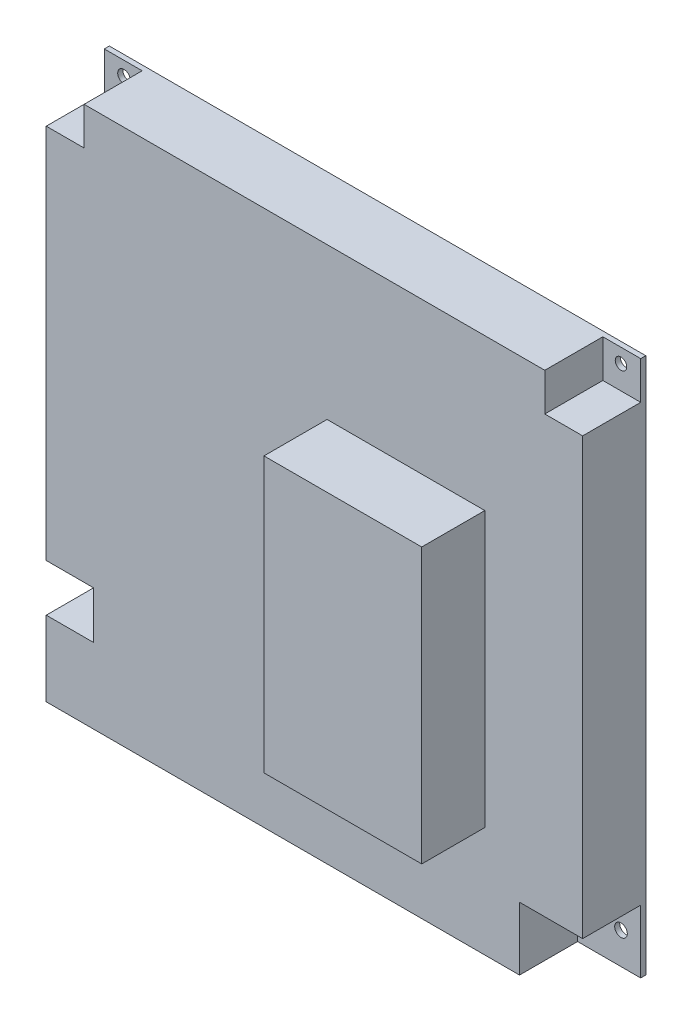
ISO-10303-21;
HEADER;
FILE_DESCRIPTION(('STEP AP214'),'2;1');
FILE_NAME('part.step','',(''),(''),'','','');
FILE_SCHEMA(('AUTOMOTIVE_DESIGN { 1 0 10303 214 1 1 1 1 }'));
ENDSEC;
DATA;
#1=APPLICATION_CONTEXT('core data for automotive mechanical design processes');
#2=APPLICATION_PROTOCOL_DEFINITION('international standard','automotive_design',2000,#1);
#3=PRODUCT_CONTEXT('',#1,'mechanical');
#4=PRODUCT('Part','Part','',(#3));
#5=PRODUCT_RELATED_PRODUCT_CATEGORY('part','',(#4));
#6=PRODUCT_DEFINITION_FORMATION('','',#4);
#7=PRODUCT_DEFINITION_CONTEXT('part definition',#1,'design');
#8=PRODUCT_DEFINITION('design','',#6,#7);
#9=PRODUCT_DEFINITION_SHAPE('','',#8);
#10=(LENGTH_UNIT() NAMED_UNIT(*) SI_UNIT(.MILLI.,.METRE.));
#11=(NAMED_UNIT(*) PLANE_ANGLE_UNIT() SI_UNIT($,.RADIAN.));
#12=(NAMED_UNIT(*) SI_UNIT($,.STERADIAN.) SOLID_ANGLE_UNIT());
#13=UNCERTAINTY_MEASURE_WITH_UNIT(LENGTH_MEASURE(1.E-05),#10,'distance_accuracy_value','');
#14=(GEOMETRIC_REPRESENTATION_CONTEXT(3) GLOBAL_UNCERTAINTY_ASSIGNED_CONTEXT((#13)) GLOBAL_UNIT_ASSIGNED_CONTEXT((#10,
#11,#12)) REPRESENTATION_CONTEXT('',''));
#15=CARTESIAN_POINT('',(0.,0.,0.));
#16=DIRECTION('',(0.,0.,1.));
#17=DIRECTION('',(1.,0.,0.));
#18=AXIS2_PLACEMENT_3D('',#15,#16,#17);
#19=CARTESIAN_POINT('',(0.,0.,20.));
#20=DIRECTION('',(0.,0.,1.));
#21=DIRECTION('',(1.,0.,0.));
#22=AXIS2_PLACEMENT_3D('',#19,#20,#21);
#23=PLANE('',#22);
#24=DIRECTION('',(0.,-1.,0.));
#25=VECTOR('',#24,1.);
#26=CARTESIAN_POINT('',(65.,-65.,20.));
#27=LINE('',#26,#25);
#28=CARTESIAN_POINT('',(65.,-65.,20.));
#29=VERTEX_POINT('',#28);
#30=CARTESIAN_POINT('',(65.,-85.,20.));
#31=VERTEX_POINT('',#30);
#32=EDGE_CURVE('E242',#29,#31,#27,.T.);
#33=ORIENTED_EDGE('',*,*,#32,.F.);
#34=DIRECTION('',(-1.,0.,0.));
#35=VECTOR('',#34,1.);
#36=CARTESIAN_POINT('',(65.,-65.,20.));
#37=LINE('',#36,#35);
#38=CARTESIAN_POINT('',(85.,-65.,20.));
#39=VERTEX_POINT('',#38);
#40=EDGE_CURVE('E234',#39,#29,#37,.T.);
#41=ORIENTED_EDGE('',*,*,#40,.F.);
#42=DIRECTION('',(0.,1.,0.));
#43=VECTOR('',#42,1.);
#44=CARTESIAN_POINT('',(85.,85.,20.));
#45=LINE('',#44,#43);
#46=CARTESIAN_POINT('',(85.,73.,20.));
#47=VERTEX_POINT('',#46);
#48=EDGE_CURVE('E332',#39,#47,#45,.T.);
#49=ORIENTED_EDGE('',*,*,#48,.T.);
#50=DIRECTION('',(1.,0.,0.));
#51=VECTOR('',#50,1.);
#52=CARTESIAN_POINT('',(73.,73.,20.));
#53=LINE('',#52,#51);
#54=CARTESIAN_POINT('',(73.,73.,20.));
#55=VERTEX_POINT('',#54);
#56=EDGE_CURVE('E258',#55,#47,#53,.T.);
#57=ORIENTED_EDGE('',*,*,#56,.F.);
#58=DIRECTION('',(0.,-1.,0.));
#59=VECTOR('',#58,1.);
#60=CARTESIAN_POINT('',(73.,85.,20.));
#61=LINE('',#60,#59);
#62=CARTESIAN_POINT('',(73.,85.,20.));
#63=VERTEX_POINT('',#62);
#64=EDGE_CURVE('E56',#63,#55,#61,.T.);
#65=ORIENTED_EDGE('',*,*,#64,.F.);
#66=DIRECTION('',(-1.,0.,0.));
#67=VECTOR('',#66,1.);
#68=CARTESIAN_POINT('',(-85.,85.,20.));
#69=LINE('',#68,#67);
#70=CARTESIAN_POINT('',(-73.,85.,20.));
#71=VERTEX_POINT('',#70);
#72=EDGE_CURVE('E335',#63,#71,#69,.T.);
#73=ORIENTED_EDGE('',*,*,#72,.T.);
#74=DIRECTION('',(0.,1.,0.));
#75=VECTOR('',#74,1.);
#76=CARTESIAN_POINT('',(-73.,85.,20.));
#77=LINE('',#76,#75);
#78=CARTESIAN_POINT('',(-73.,73.,20.));
#79=VERTEX_POINT('',#78);
#80=EDGE_CURVE('E279',#79,#71,#77,.T.);
#81=ORIENTED_EDGE('',*,*,#80,.F.);
#82=DIRECTION('',(1.,0.,0.));
#83=VECTOR('',#82,1.);
#84=CARTESIAN_POINT('',(-85.,73.,20.));
#85=LINE('',#84,#83);
#86=CARTESIAN_POINT('',(-85.,73.,20.));
#87=VERTEX_POINT('',#86);
#88=EDGE_CURVE('E288',#87,#79,#85,.T.);
#89=ORIENTED_EDGE('',*,*,#88,.F.);
#90=DIRECTION('',(0.,-1.,0.));
#91=VECTOR('',#90,1.);
#92=CARTESIAN_POINT('',(-85.,85.,20.));
#93=LINE('',#92,#91);
#94=CARTESIAN_POINT('',(-85.,-46.2117176918819,20.));
#95=VERTEX_POINT('',#94);
#96=EDGE_CURVE('E327',#87,#95,#93,.T.);
#97=ORIENTED_EDGE('',*,*,#96,.T.);
#98=DIRECTION('',(-1.,0.,0.));
#99=VECTOR('',#98,1.);
#100=CARTESIAN_POINT('',(-85.,-46.2117176918819,20.));
#101=LINE('',#100,#99);
#102=CARTESIAN_POINT('',(-70.,-46.2117176918819,20.));
#103=VERTEX_POINT('',#102);
#104=EDGE_CURVE('E302',#103,#95,#101,.T.);
#105=ORIENTED_EDGE('',*,*,#104,.F.);
#106=DIRECTION('',(0.,1.,0.));
#107=VECTOR('',#106,1.);
#108=CARTESIAN_POINT('',(-70.,-46.2117176918819,20.));
#109=LINE('',#108,#107);
#110=CARTESIAN_POINT('',(-70.,-61.2117176918819,20.));
#111=VERTEX_POINT('',#110);
#112=EDGE_CURVE('E314',#111,#103,#109,.T.);
#113=ORIENTED_EDGE('',*,*,#112,.F.);
#114=DIRECTION('',(1.,0.,0.));
#115=VECTOR('',#114,1.);
#116=CARTESIAN_POINT('',(-85.,-61.2117176918819,20.));
#117=LINE('',#116,#115);
#118=CARTESIAN_POINT('',(-85.,-61.2117176918819,20.));
#119=VERTEX_POINT('',#118);
#120=EDGE_CURVE('E229',#119,#111,#117,.T.);
#121=ORIENTED_EDGE('',*,*,#120,.F.);
#122=CARTESIAN_POINT('',(-85.,-85.,20.));
#123=VERTEX_POINT('',#122);
#124=EDGE_CURVE('E325',#119,#123,#93,.T.);
#125=ORIENTED_EDGE('',*,*,#124,.T.);
#126=DIRECTION('',(1.,0.,0.));
#127=VECTOR('',#126,1.);
#128=CARTESIAN_POINT('',(-85.,-85.,20.));
#129=LINE('',#128,#127);
#130=EDGE_CURVE('E329',#123,#31,#129,.T.);
#131=ORIENTED_EDGE('',*,*,#130,.T.);
#132=EDGE_LOOP('',(#33,#41,#49,#57,#65,#73,#81,#89,#97,#105,#113,#121,#125,#131));
#133=FACE_BOUND('',#132,.T.);
#134=DIRECTION('',(1.,0.,0.));
#135=VECTOR('',#134,1.);
#136=CARTESIAN_POINT('',(4.,-50.,20.));
#137=LINE('',#136,#135);
#138=CARTESIAN_POINT('',(4.,-50.,20.));
#139=VERTEX_POINT('',#138);
#140=CARTESIAN_POINT('',(54.,-50.,20.));
#141=VERTEX_POINT('',#140);
#142=EDGE_CURVE('E655',#139,#141,#137,.T.);
#143=ORIENTED_EDGE('',*,*,#142,.F.);
#144=DIRECTION('',(0.,-1.,0.));
#145=VECTOR('',#144,1.);
#146=CARTESIAN_POINT('',(3.99999999999998,37.,20.));
#147=LINE('',#146,#145);
#148=CARTESIAN_POINT('',(3.99999999999998,37.,20.));
#149=VERTEX_POINT('',#148);
#150=EDGE_CURVE('E199',#149,#139,#147,.T.);
#151=ORIENTED_EDGE('',*,*,#150,.F.);
#152=DIRECTION('',(-1.,0.,0.));
#153=VECTOR('',#152,1.);
#154=CARTESIAN_POINT('',(3.99999999999998,37.,20.));
#155=LINE('',#154,#153);
#156=CARTESIAN_POINT('',(54.,37.,20.));
#157=VERTEX_POINT('',#156);
#158=EDGE_CURVE('E195',#157,#149,#155,.T.);
#159=ORIENTED_EDGE('',*,*,#158,.F.);
#160=DIRECTION('',(0.,1.,0.));
#161=VECTOR('',#160,1.);
#162=CARTESIAN_POINT('',(54.,37.,20.));
#163=LINE('',#162,#161);
#164=EDGE_CURVE('E652',#141,#157,#163,.T.);
#165=ORIENTED_EDGE('',*,*,#164,.F.);
#166=EDGE_LOOP('',(#143,#151,#159,#165));
#167=FACE_BOUND('',#166,.T.);
#168=ADVANCED_FACE('F33',(#133,#167),#23,.T.);
#169=CARTESIAN_POINT('',(-85.,85.,20.));
#170=DIRECTION('',(1.,0.,0.));
#171=DIRECTION('',(0.,1.,0.));
#172=AXIS2_PLACEMENT_3D('',#169,#170,#171);
#173=PLANE('',#172);
#174=ORIENTED_EDGE('',*,*,#96,.F.);
#175=DIRECTION('',(0.,0.,1.));
#176=VECTOR('',#175,1.);
#177=CARTESIAN_POINT('',(-85.,73.,1.6));
#178=LINE('',#177,#176);
#179=CARTESIAN_POINT('',(-85.,73.,1.6));
#180=VERTEX_POINT('',#179);
#181=EDGE_CURVE('E287',#180,#87,#178,.T.);
#182=ORIENTED_EDGE('',*,*,#181,.F.);
#183=DIRECTION('',(0.,-1.,0.));
#184=VECTOR('',#183,1.);
#185=CARTESIAN_POINT('',(-85.,85.,1.6));
#186=LINE('',#185,#184);
#187=CARTESIAN_POINT('',(-85.,85.,1.6));
#188=VERTEX_POINT('',#187);
#189=EDGE_CURVE('E275',#188,#180,#186,.T.);
#190=ORIENTED_EDGE('',*,*,#189,.F.);
#191=DIRECTION('',(0.,0.,-1.));
#192=VECTOR('',#191,1.);
#193=CARTESIAN_POINT('',(-85.,85.,20.));
#194=LINE('',#193,#192);
#195=CARTESIAN_POINT('',(-85.,85.,0.));
#196=VERTEX_POINT('',#195);
#197=EDGE_CURVE('E338',#188,#196,#194,.T.);
#198=ORIENTED_EDGE('',*,*,#197,.T.);
#199=DIRECTION('',(0.,-1.,0.));
#200=VECTOR('',#199,1.);
#201=CARTESIAN_POINT('',(-85.,85.,0.));
#202=LINE('',#201,#200);
#203=CARTESIAN_POINT('',(-85.,-85.,0.));
#204=VERTEX_POINT('',#203);
#205=EDGE_CURVE('E249',#196,#204,#202,.T.);
#206=ORIENTED_EDGE('',*,*,#205,.T.);
#207=DIRECTION('',(0.,0.,-1.));
#208=VECTOR('',#207,1.);
#209=CARTESIAN_POINT('',(-85.,-85.,20.));
#210=LINE('',#209,#208);
#211=EDGE_CURVE('E11',#123,#204,#210,.T.);
#212=ORIENTED_EDGE('',*,*,#211,.F.);
#213=ORIENTED_EDGE('',*,*,#124,.F.);
#214=DIRECTION('',(0.,0.,1.));
#215=VECTOR('',#214,1.);
#216=CARTESIAN_POINT('',(-85.,-61.2117176918819,1.6));
#217=LINE('',#216,#215);
#218=CARTESIAN_POINT('',(-85.,-61.2117176918819,1.6));
#219=VERTEX_POINT('',#218);
#220=EDGE_CURVE('E311',#219,#119,#217,.T.);
#221=ORIENTED_EDGE('',*,*,#220,.F.);
#222=DIRECTION('',(0.,-1.,0.));
#223=VECTOR('',#222,1.);
#224=CARTESIAN_POINT('',(-85.,-46.2117176918819,1.6));
#225=LINE('',#224,#223);
#226=CARTESIAN_POINT('',(-85.,-46.2117176918819,1.6));
#227=VERTEX_POINT('',#226);
#228=EDGE_CURVE('E298',#227,#219,#225,.T.);
#229=ORIENTED_EDGE('',*,*,#228,.F.);
#230=DIRECTION('',(0.,0.,1.));
#231=VECTOR('',#230,1.);
#232=CARTESIAN_POINT('',(-85.,-46.2117176918819,1.6));
#233=LINE('',#232,#231);
#234=EDGE_CURVE('E291',#227,#95,#233,.T.);
#235=ORIENTED_EDGE('',*,*,#234,.T.);
#236=EDGE_LOOP('',(#174,#182,#190,#198,#206,#212,#213,#221,#229,#235));
#237=FACE_BOUND('',#236,.T.);
#238=ADVANCED_FACE('F35',(#237),#173,.F.);
#239=CARTESIAN_POINT('',(-85.,-85.,20.));
#240=DIRECTION('',(0.,1.,0.));
#241=DIRECTION('',(0.,0.,1.));
#242=AXIS2_PLACEMENT_3D('',#239,#240,#241);
#243=PLANE('',#242);
#244=DIRECTION('',(1.,0.,0.));
#245=VECTOR('',#244,1.);
#246=CARTESIAN_POINT('',(65.,-85.,1.6));
#247=LINE('',#246,#245);
#248=CARTESIAN_POINT('',(65.,-85.,1.6));
#249=VERTEX_POINT('',#248);
#250=CARTESIAN_POINT('',(85.,-85.,1.6));
#251=VERTEX_POINT('',#250);
#252=EDGE_CURVE('E233',#249,#251,#247,.T.);
#253=ORIENTED_EDGE('',*,*,#252,.F.);
#254=DIRECTION('',(0.,0.,1.));
#255=VECTOR('',#254,1.);
#256=CARTESIAN_POINT('',(65.,-85.,1.6));
#257=LINE('',#256,#255);
#258=EDGE_CURVE('E241',#249,#31,#257,.T.);
#259=ORIENTED_EDGE('',*,*,#258,.T.);
#260=ORIENTED_EDGE('',*,*,#130,.F.);
#261=ORIENTED_EDGE('',*,*,#211,.T.);
#262=DIRECTION('',(1.,0.,0.));
#263=VECTOR('',#262,1.);
#264=CARTESIAN_POINT('',(-85.,-85.,0.));
#265=LINE('',#264,#263);
#266=CARTESIAN_POINT('',(85.,-85.,0.));
#267=VERTEX_POINT('',#266);
#268=EDGE_CURVE('E341',#204,#267,#265,.T.);
#269=ORIENTED_EDGE('',*,*,#268,.T.);
#270=DIRECTION('',(0.,0.,-1.));
#271=VECTOR('',#270,1.);
#272=CARTESIAN_POINT('',(85.,-85.,20.));
#273=LINE('',#272,#271);
#274=EDGE_CURVE('E41',#251,#267,#273,.T.);
#275=ORIENTED_EDGE('',*,*,#274,.F.);
#276=EDGE_LOOP('',(#253,#259,#260,#261,#269,#275));
#277=FACE_BOUND('',#276,.T.);
#278=ADVANCED_FACE('F362',(#277),#243,.F.);
#279=CARTESIAN_POINT('',(85.,85.,20.));
#280=DIRECTION('',(-1.,0.,0.));
#281=DIRECTION('',(0.,-1.,0.));
#282=AXIS2_PLACEMENT_3D('',#279,#280,#281);
#283=PLANE('',#282);
#284=ORIENTED_EDGE('',*,*,#48,.F.);
#285=DIRECTION('',(0.,0.,1.));
#286=VECTOR('',#285,1.);
#287=CARTESIAN_POINT('',(85.,-65.,1.6));
#288=LINE('',#287,#286);
#289=CARTESIAN_POINT('',(85.,-65.,1.6));
#290=VERTEX_POINT('',#289);
#291=EDGE_CURVE('E250',#290,#39,#288,.T.);
#292=ORIENTED_EDGE('',*,*,#291,.F.);
#293=DIRECTION('',(0.,1.,0.));
#294=VECTOR('',#293,1.);
#295=CARTESIAN_POINT('',(85.,-65.,1.6));
#296=LINE('',#295,#294);
#297=EDGE_CURVE('E236',#251,#290,#296,.T.);
#298=ORIENTED_EDGE('',*,*,#297,.F.);
#299=ORIENTED_EDGE('',*,*,#274,.T.);
#300=DIRECTION('',(0.,1.,0.));
#301=VECTOR('',#300,1.);
#302=CARTESIAN_POINT('',(85.,85.,0.));
#303=LINE('',#302,#301);
#304=CARTESIAN_POINT('',(85.,85.,0.));
#305=VERTEX_POINT('',#304);
#306=EDGE_CURVE('E344',#267,#305,#303,.T.);
#307=ORIENTED_EDGE('',*,*,#306,.T.);
#308=DIRECTION('',(0.,0.,-1.));
#309=VECTOR('',#308,1.);
#310=CARTESIAN_POINT('',(85.,85.,20.));
#311=LINE('',#310,#309);
#312=CARTESIAN_POINT('',(85.,85.,1.6));
#313=VERTEX_POINT('',#312);
#314=EDGE_CURVE('E350',#313,#305,#311,.T.);
#315=ORIENTED_EDGE('',*,*,#314,.F.);
#316=DIRECTION('',(0.,1.,0.));
#317=VECTOR('',#316,1.);
#318=CARTESIAN_POINT('',(85.,85.,1.6));
#319=LINE('',#318,#317);
#320=CARTESIAN_POINT('',(85.,73.,1.6));
#321=VERTEX_POINT('',#320);
#322=EDGE_CURVE('E261',#321,#313,#319,.T.);
#323=ORIENTED_EDGE('',*,*,#322,.F.);
#324=DIRECTION('',(0.,0.,1.));
#325=VECTOR('',#324,1.);
#326=CARTESIAN_POINT('',(85.,73.,1.6));
#327=LINE('',#326,#325);
#328=EDGE_CURVE('E271',#321,#47,#327,.T.);
#329=ORIENTED_EDGE('',*,*,#328,.T.);
#330=EDGE_LOOP('',(#284,#292,#298,#299,#307,#315,#323,#329));
#331=FACE_BOUND('',#330,.T.);
#332=ADVANCED_FACE('F355',(#331),#283,.F.);
#333=CARTESIAN_POINT('',(-85.,85.,20.));
#334=DIRECTION('',(0.,-1.,0.));
#335=DIRECTION('',(0.,0.,-1.));
#336=AXIS2_PLACEMENT_3D('',#333,#334,#335);
#337=PLANE('',#336);
#338=ORIENTED_EDGE('',*,*,#72,.F.);
#339=DIRECTION('',(0.,0.,1.));
#340=VECTOR('',#339,1.);
#341=CARTESIAN_POINT('',(73.,85.,1.6));
#342=LINE('',#341,#340);
#343=CARTESIAN_POINT('',(73.,85.,1.6));
#344=VERTEX_POINT('',#343);
#345=EDGE_CURVE('E244',#344,#63,#342,.T.);
#346=ORIENTED_EDGE('',*,*,#345,.F.);
#347=DIRECTION('',(-1.,0.,0.));
#348=VECTOR('',#347,1.);
#349=CARTESIAN_POINT('',(73.,85.,1.6));
#350=LINE('',#349,#348);
#351=EDGE_CURVE('E263',#313,#344,#350,.T.);
#352=ORIENTED_EDGE('',*,*,#351,.F.);
#353=ORIENTED_EDGE('',*,*,#314,.T.);
#354=DIRECTION('',(-1.,0.,0.));
#355=VECTOR('',#354,1.);
#356=CARTESIAN_POINT('',(-85.,85.,0.));
#357=LINE('',#356,#355);
#358=EDGE_CURVE('E328',#305,#196,#357,.T.);
#359=ORIENTED_EDGE('',*,*,#358,.T.);
#360=ORIENTED_EDGE('',*,*,#197,.F.);
#361=DIRECTION('',(-1.,0.,0.));
#362=VECTOR('',#361,1.);
#363=CARTESIAN_POINT('',(-85.,85.,1.6));
#364=LINE('',#363,#362);
#365=CARTESIAN_POINT('',(-73.,85.,1.6));
#366=VERTEX_POINT('',#365);
#367=EDGE_CURVE('E285',#366,#188,#364,.T.);
#368=ORIENTED_EDGE('',*,*,#367,.F.);
#369=DIRECTION('',(0.,0.,1.));
#370=VECTOR('',#369,1.);
#371=CARTESIAN_POINT('',(-73.,85.,1.6));
#372=LINE('',#371,#370);
#373=EDGE_CURVE('E268',#366,#71,#372,.T.);
#374=ORIENTED_EDGE('',*,*,#373,.T.);
#375=EDGE_LOOP('',(#338,#346,#352,#353,#359,#360,#368,#374));
#376=FACE_BOUND('',#375,.T.);
#377=ADVANCED_FACE('F371',(#376),#337,.F.);
#378=CARTESIAN_POINT('',(0.,0.,0.));
#379=DIRECTION('',(0.,0.,1.));
#380=DIRECTION('',(1.,0.,0.));
#381=AXIS2_PLACEMENT_3D('',#378,#379,#380);
#382=PLANE('',#381);
#383=CARTESIAN_POINT('',(78.75,-75.,0.));
#384=DIRECTION('',(0.,0.,1.));
#385=DIRECTION('',(1.,0.,0.));
#386=AXIS2_PLACEMENT_3D('',#383,#384,#385);
#387=CIRCLE('',#386,2.);
#388=CARTESIAN_POINT('',(80.75,-75.,0.));
#389=VERTEX_POINT('',#388);
#390=EDGE_CURVE('E212',#389,#389,#387,.T.);
#391=ORIENTED_EDGE('',*,*,#390,.T.);
#392=EDGE_LOOP('',(#391));
#393=FACE_BOUND('',#392,.T.);
#394=CARTESIAN_POINT('',(78.75,80.5,0.));
#395=DIRECTION('',(0.,0.,1.));
#396=DIRECTION('',(1.,0.,0.));
#397=AXIS2_PLACEMENT_3D('',#394,#395,#396);
#398=CIRCLE('',#397,1.82271494033159);
#399=CARTESIAN_POINT('',(80.5727149403316,80.5,0.));
#400=VERTEX_POINT('',#399);
#401=EDGE_CURVE('E220',#400,#400,#398,.T.);
#402=ORIENTED_EDGE('',*,*,#401,.T.);
#403=EDGE_LOOP('',(#402));
#404=FACE_BOUND('',#403,.T.);
#405=CARTESIAN_POINT('',(-78.75,80.5,0.));
#406=DIRECTION('',(0.,0.,1.));
#407=DIRECTION('',(1.,0.,0.));
#408=AXIS2_PLACEMENT_3D('',#405,#406,#407);
#409=CIRCLE('',#408,2.);
#410=CARTESIAN_POINT('',(-76.75,80.5,0.));
#411=VERTEX_POINT('',#410);
#412=EDGE_CURVE('E223',#411,#411,#409,.T.);
#413=ORIENTED_EDGE('',*,*,#412,.T.);
#414=EDGE_LOOP('',(#413));
#415=FACE_BOUND('',#414,.T.);
#416=CARTESIAN_POINT('',(-78.75,-51.5,0.));
#417=DIRECTION('',(0.,0.,1.));
#418=DIRECTION('',(1.,0.,0.));
#419=AXIS2_PLACEMENT_3D('',#416,#417,#418);
#420=CIRCLE('',#419,2.);
#421=CARTESIAN_POINT('',(-76.75,-51.5,0.));
#422=VERTEX_POINT('',#421);
#423=EDGE_CURVE('E226',#422,#422,#420,.T.);
#424=ORIENTED_EDGE('',*,*,#423,.T.);
#425=EDGE_LOOP('',(#424));
#426=FACE_BOUND('',#425,.T.);
#427=ORIENTED_EDGE('',*,*,#205,.F.);
#428=ORIENTED_EDGE('',*,*,#358,.F.);
#429=ORIENTED_EDGE('',*,*,#306,.F.);
#430=ORIENTED_EDGE('',*,*,#268,.F.);
#431=EDGE_LOOP('',(#427,#428,#429,#430));
#432=FACE_BOUND('',#431,.T.);
#433=ADVANCED_FACE('F367',(#393,#404,#415,#426,#432),#382,.F.);
#434=CARTESIAN_POINT('',(-85.,-46.2117176918819,1.6));
#435=DIRECTION('',(0.,1.,0.));
#436=DIRECTION('',(0.,0.,1.));
#437=AXIS2_PLACEMENT_3D('',#434,#435,#436);
#438=PLANE('',#437);
#439=ORIENTED_EDGE('',*,*,#104,.T.);
#440=ORIENTED_EDGE('',*,*,#234,.F.);
#441=DIRECTION('',(-1.,0.,0.));
#442=VECTOR('',#441,1.);
#443=CARTESIAN_POINT('',(-85.,-46.2117176918819,1.6));
#444=LINE('',#443,#442);
#445=CARTESIAN_POINT('',(-70.,-46.2117176918819,1.6));
#446=VERTEX_POINT('',#445);
#447=EDGE_CURVE('E308',#446,#227,#444,.T.);
#448=ORIENTED_EDGE('',*,*,#447,.F.);
#449=DIRECTION('',(0.,0.,1.));
#450=VECTOR('',#449,1.);
#451=CARTESIAN_POINT('',(-70.,-46.2117176918819,1.6));
#452=LINE('',#451,#450);
#453=EDGE_CURVE('E320',#446,#103,#452,.T.);
#454=ORIENTED_EDGE('',*,*,#453,.T.);
#455=EDGE_LOOP('',(#439,#440,#448,#454));
#456=FACE_BOUND('',#455,.T.);
#457=ADVANCED_FACE('F435',(#456),#438,.F.);
#458=CARTESIAN_POINT('',(-70.,-46.2117176918819,1.6));
#459=DIRECTION('',(1.,0.,0.));
#460=DIRECTION('',(0.,1.,0.));
#461=AXIS2_PLACEMENT_3D('',#458,#459,#460);
#462=PLANE('',#461);
#463=ORIENTED_EDGE('',*,*,#112,.T.);
#464=ORIENTED_EDGE('',*,*,#453,.F.);
#465=DIRECTION('',(0.,1.,0.));
#466=VECTOR('',#465,1.);
#467=CARTESIAN_POINT('',(-70.,-46.2117176918819,1.6));
#468=LINE('',#467,#466);
#469=CARTESIAN_POINT('',(-70.,-61.2117176918819,1.6));
#470=VERTEX_POINT('',#469);
#471=EDGE_CURVE('E305',#470,#446,#468,.T.);
#472=ORIENTED_EDGE('',*,*,#471,.F.);
#473=DIRECTION('',(0.,0.,1.));
#474=VECTOR('',#473,1.);
#475=CARTESIAN_POINT('',(-70.,-61.2117176918819,1.6));
#476=LINE('',#475,#474);
#477=EDGE_CURVE('E322',#470,#111,#476,.T.);
#478=ORIENTED_EDGE('',*,*,#477,.T.);
#479=EDGE_LOOP('',(#463,#464,#472,#478));
#480=FACE_BOUND('',#479,.T.);
#481=ADVANCED_FACE('F465',(#480),#462,.F.);
#482=CARTESIAN_POINT('',(-85.,-61.2117176918819,1.6));
#483=DIRECTION('',(0.,-1.,0.));
#484=DIRECTION('',(0.,0.,-1.));
#485=AXIS2_PLACEMENT_3D('',#482,#483,#484);
#486=PLANE('',#485);
#487=ORIENTED_EDGE('',*,*,#120,.T.);
#488=ORIENTED_EDGE('',*,*,#477,.F.);
#489=DIRECTION('',(1.,0.,0.));
#490=VECTOR('',#489,1.);
#491=CARTESIAN_POINT('',(-85.,-61.2117176918819,1.6));
#492=LINE('',#491,#490);
#493=EDGE_CURVE('E301',#219,#470,#492,.T.);
#494=ORIENTED_EDGE('',*,*,#493,.F.);
#495=ORIENTED_EDGE('',*,*,#220,.T.);
#496=EDGE_LOOP('',(#487,#488,#494,#495));
#497=FACE_BOUND('',#496,.T.);
#498=ADVANCED_FACE('F431',(#497),#486,.F.);
#499=CARTESIAN_POINT('',(0.,0.,1.6));
#500=DIRECTION('',(0.,0.,1.));
#501=DIRECTION('',(1.,0.,0.));
#502=AXIS2_PLACEMENT_3D('',#499,#500,#501);
#503=PLANE('',#502);
#504=CARTESIAN_POINT('',(-78.75,-51.5,1.6));
#505=DIRECTION('',(0.,0.,1.));
#506=DIRECTION('',(1.,0.,0.));
#507=AXIS2_PLACEMENT_3D('',#504,#505,#506);
#508=CIRCLE('',#507,2.);
#509=CARTESIAN_POINT('',(-76.75,-51.5,1.6));
#510=VERTEX_POINT('',#509);
#511=EDGE_CURVE('E201',#510,#510,#508,.T.);
#512=ORIENTED_EDGE('',*,*,#511,.F.);
#513=EDGE_LOOP('',(#512));
#514=FACE_BOUND('',#513,.T.);
#515=ORIENTED_EDGE('',*,*,#228,.T.);
#516=ORIENTED_EDGE('',*,*,#493,.T.);
#517=ORIENTED_EDGE('',*,*,#471,.T.);
#518=ORIENTED_EDGE('',*,*,#447,.T.);
#519=EDGE_LOOP('',(#515,#516,#517,#518));
#520=FACE_BOUND('',#519,.T.);
#521=ADVANCED_FACE('F421',(#514,#520),#503,.T.);
#522=CARTESIAN_POINT('',(-73.,85.,1.6));
#523=DIRECTION('',(1.,0.,0.));
#524=DIRECTION('',(0.,0.,-1.));
#525=AXIS2_PLACEMENT_3D('',#522,#523,#524);
#526=PLANE('',#525);
#527=ORIENTED_EDGE('',*,*,#80,.T.);
#528=ORIENTED_EDGE('',*,*,#373,.F.);
#529=DIRECTION('',(0.,1.,0.));
#530=VECTOR('',#529,1.);
#531=CARTESIAN_POINT('',(-73.,85.,1.6));
#532=LINE('',#531,#530);
#533=CARTESIAN_POINT('',(-73.,73.,1.6));
#534=VERTEX_POINT('',#533);
#535=EDGE_CURVE('E282',#534,#366,#532,.T.);
#536=ORIENTED_EDGE('',*,*,#535,.F.);
#537=DIRECTION('',(0.,0.,1.));
#538=VECTOR('',#537,1.);
#539=CARTESIAN_POINT('',(-73.,73.,1.6));
#540=LINE('',#539,#538);
#541=EDGE_CURVE('E295',#534,#79,#540,.T.);
#542=ORIENTED_EDGE('',*,*,#541,.T.);
#543=EDGE_LOOP('',(#527,#528,#536,#542));
#544=FACE_BOUND('',#543,.T.);
#545=ADVANCED_FACE('F409',(#544),#526,.F.);
#546=CARTESIAN_POINT('',(-85.,73.,1.6));
#547=DIRECTION('',(0.,-1.,0.));
#548=DIRECTION('',(0.,0.,-1.));
#549=AXIS2_PLACEMENT_3D('',#546,#547,#548);
#550=PLANE('',#549);
#551=ORIENTED_EDGE('',*,*,#88,.T.);
#552=ORIENTED_EDGE('',*,*,#541,.F.);
#553=DIRECTION('',(1.,0.,0.));
#554=VECTOR('',#553,1.);
#555=CARTESIAN_POINT('',(-85.,73.,1.6));
#556=LINE('',#555,#554);
#557=EDGE_CURVE('E278',#180,#534,#556,.T.);
#558=ORIENTED_EDGE('',*,*,#557,.F.);
#559=ORIENTED_EDGE('',*,*,#181,.T.);
#560=EDGE_LOOP('',(#551,#552,#558,#559));
#561=FACE_BOUND('',#560,.T.);
#562=ADVANCED_FACE('F411',(#561),#550,.F.);
#563=CARTESIAN_POINT('',(0.,0.,1.6));
#564=DIRECTION('',(0.,0.,1.));
#565=DIRECTION('',(1.,0.,0.));
#566=AXIS2_PLACEMENT_3D('',#563,#564,#565);
#567=PLANE('',#566);
#568=CARTESIAN_POINT('',(-78.75,80.5,1.6));
#569=DIRECTION('',(0.,0.,1.));
#570=DIRECTION('',(1.,0.,0.));
#571=AXIS2_PLACEMENT_3D('',#568,#569,#570);
#572=CIRCLE('',#571,2.);
#573=CARTESIAN_POINT('',(-76.75,80.5,1.6));
#574=VERTEX_POINT('',#573);
#575=EDGE_CURVE('E204',#574,#574,#572,.T.);
#576=ORIENTED_EDGE('',*,*,#575,.F.);
#577=EDGE_LOOP('',(#576));
#578=FACE_BOUND('',#577,.T.);
#579=ORIENTED_EDGE('',*,*,#189,.T.);
#580=ORIENTED_EDGE('',*,*,#557,.T.);
#581=ORIENTED_EDGE('',*,*,#535,.T.);
#582=ORIENTED_EDGE('',*,*,#367,.T.);
#583=EDGE_LOOP('',(#579,#580,#581,#582));
#584=FACE_BOUND('',#583,.T.);
#585=ADVANCED_FACE('F403',(#578,#584),#567,.T.);
#586=CARTESIAN_POINT('',(73.,85.,1.6));
#587=DIRECTION('',(-1.,0.,0.));
#588=DIRECTION('',(0.,0.,1.));
#589=AXIS2_PLACEMENT_3D('',#586,#587,#588);
#590=PLANE('',#589);
#591=ORIENTED_EDGE('',*,*,#64,.T.);
#592=DIRECTION('',(0.,0.,1.));
#593=VECTOR('',#592,1.);
#594=CARTESIAN_POINT('',(73.,73.,1.6));
#595=LINE('',#594,#593);
#596=CARTESIAN_POINT('',(73.,73.,1.6));
#597=VERTEX_POINT('',#596);
#598=EDGE_CURVE('E266',#597,#55,#595,.T.);
#599=ORIENTED_EDGE('',*,*,#598,.F.);
#600=DIRECTION('',(0.,-1.,0.));
#601=VECTOR('',#600,1.);
#602=CARTESIAN_POINT('',(73.,85.,1.6));
#603=LINE('',#602,#601);
#604=EDGE_CURVE('E254',#344,#597,#603,.T.);
#605=ORIENTED_EDGE('',*,*,#604,.F.);
#606=ORIENTED_EDGE('',*,*,#345,.T.);
#607=EDGE_LOOP('',(#591,#599,#605,#606));
#608=FACE_BOUND('',#607,.T.);
#609=ADVANCED_FACE('F418',(#608),#590,.F.);
#610=CARTESIAN_POINT('',(73.,73.,1.6));
#611=DIRECTION('',(0.,-1.,0.));
#612=DIRECTION('',(0.,0.,-1.));
#613=AXIS2_PLACEMENT_3D('',#610,#611,#612);
#614=PLANE('',#613);
#615=ORIENTED_EDGE('',*,*,#56,.T.);
#616=ORIENTED_EDGE('',*,*,#328,.F.);
#617=DIRECTION('',(1.,0.,0.));
#618=VECTOR('',#617,1.);
#619=CARTESIAN_POINT('',(73.,73.,1.6));
#620=LINE('',#619,#618);
#621=EDGE_CURVE('E257',#597,#321,#620,.T.);
#622=ORIENTED_EDGE('',*,*,#621,.F.);
#623=ORIENTED_EDGE('',*,*,#598,.T.);
#624=EDGE_LOOP('',(#615,#616,#622,#623));
#625=FACE_BOUND('',#624,.T.);
#626=ADVANCED_FACE('F380',(#625),#614,.F.);
#627=CARTESIAN_POINT('',(0.,0.,1.6));
#628=DIRECTION('',(0.,0.,1.));
#629=DIRECTION('',(1.,0.,0.));
#630=AXIS2_PLACEMENT_3D('',#627,#628,#629);
#631=PLANE('',#630);
#632=CARTESIAN_POINT('',(78.75,80.5,1.6));
#633=DIRECTION('',(0.,0.,1.));
#634=DIRECTION('',(1.,0.,0.));
#635=AXIS2_PLACEMENT_3D('',#632,#633,#634);
#636=CIRCLE('',#635,1.82271494033159);
#637=CARTESIAN_POINT('',(80.5727149403316,80.5,1.6));
#638=VERTEX_POINT('',#637);
#639=EDGE_CURVE('E213',#638,#638,#636,.T.);
#640=ORIENTED_EDGE('',*,*,#639,.F.);
#641=EDGE_LOOP('',(#640));
#642=FACE_BOUND('',#641,.T.);
#643=ORIENTED_EDGE('',*,*,#604,.T.);
#644=ORIENTED_EDGE('',*,*,#621,.T.);
#645=ORIENTED_EDGE('',*,*,#322,.T.);
#646=ORIENTED_EDGE('',*,*,#351,.T.);
#647=EDGE_LOOP('',(#643,#644,#645,#646));
#648=FACE_BOUND('',#647,.T.);
#649=ADVANCED_FACE('F377',(#642,#648),#631,.T.);
#650=CARTESIAN_POINT('',(65.,-65.,1.6));
#651=DIRECTION('',(-1.,0.,0.));
#652=DIRECTION('',(0.,0.,1.));
#653=AXIS2_PLACEMENT_3D('',#650,#651,#652);
#654=PLANE('',#653);
#655=ORIENTED_EDGE('',*,*,#32,.T.);
#656=ORIENTED_EDGE('',*,*,#258,.F.);
#657=DIRECTION('',(0.,-1.,0.));
#658=VECTOR('',#657,1.);
#659=CARTESIAN_POINT('',(65.,-65.,1.6));
#660=LINE('',#659,#658);
#661=CARTESIAN_POINT('',(65.,-65.,1.6));
#662=VERTEX_POINT('',#661);
#663=EDGE_CURVE('E230',#662,#249,#660,.T.);
#664=ORIENTED_EDGE('',*,*,#663,.F.);
#665=DIRECTION('',(0.,0.,1.));
#666=VECTOR('',#665,1.);
#667=CARTESIAN_POINT('',(65.,-65.,1.6));
#668=LINE('',#667,#666);
#669=EDGE_CURVE('E247',#662,#29,#668,.T.);
#670=ORIENTED_EDGE('',*,*,#669,.T.);
#671=EDGE_LOOP('',(#655,#656,#664,#670));
#672=FACE_BOUND('',#671,.T.);
#673=ADVANCED_FACE('F517',(#672),#654,.F.);
#674=CARTESIAN_POINT('',(65.,-65.,1.6));
#675=DIRECTION('',(0.,1.,0.));
#676=DIRECTION('',(0.,0.,1.));
#677=AXIS2_PLACEMENT_3D('',#674,#675,#676);
#678=PLANE('',#677);
#679=ORIENTED_EDGE('',*,*,#40,.T.);
#680=ORIENTED_EDGE('',*,*,#669,.F.);
#681=DIRECTION('',(-1.,0.,0.));
#682=VECTOR('',#681,1.);
#683=CARTESIAN_POINT('',(65.,-65.,1.6));
#684=LINE('',#683,#682);
#685=EDGE_CURVE('E238',#290,#662,#684,.T.);
#686=ORIENTED_EDGE('',*,*,#685,.F.);
#687=ORIENTED_EDGE('',*,*,#291,.T.);
#688=EDGE_LOOP('',(#679,#680,#686,#687));
#689=FACE_BOUND('',#688,.T.);
#690=ADVANCED_FACE('F388',(#689),#678,.F.);
#691=CARTESIAN_POINT('',(0.,0.,1.6));
#692=DIRECTION('',(0.,0.,1.));
#693=DIRECTION('',(1.,0.,0.));
#694=AXIS2_PLACEMENT_3D('',#691,#692,#693);
#695=PLANE('',#694);
#696=CARTESIAN_POINT('',(78.75,-75.,1.6));
#697=DIRECTION('',(0.,0.,1.));
#698=DIRECTION('',(1.,0.,0.));
#699=AXIS2_PLACEMENT_3D('',#696,#697,#698);
#700=CIRCLE('',#699,2.);
#701=CARTESIAN_POINT('',(80.75,-75.,1.6));
#702=VERTEX_POINT('',#701);
#703=EDGE_CURVE('E209',#702,#702,#700,.T.);
#704=ORIENTED_EDGE('',*,*,#703,.F.);
#705=EDGE_LOOP('',(#704));
#706=FACE_BOUND('',#705,.T.);
#707=ORIENTED_EDGE('',*,*,#663,.T.);
#708=ORIENTED_EDGE('',*,*,#252,.T.);
#709=ORIENTED_EDGE('',*,*,#297,.T.);
#710=ORIENTED_EDGE('',*,*,#685,.T.);
#711=EDGE_LOOP('',(#707,#708,#709,#710));
#712=FACE_BOUND('',#711,.T.);
#713=ADVANCED_FACE('F391',(#706,#712),#695,.T.);
#714=CARTESIAN_POINT('',(78.75,-75.,-16.8));
#715=DIRECTION('',(0.,0.,1.));
#716=DIRECTION('',(1.,0.,0.));
#717=AXIS2_PLACEMENT_3D('',#714,#715,#716);
#718=CYLINDRICAL_SURFACE('',#717,2.);
#719=ORIENTED_EDGE('',*,*,#703,.T.);
#720=EDGE_LOOP('',(#719));
#721=FACE_BOUND('',#720,.T.);
#722=ORIENTED_EDGE('',*,*,#390,.F.);
#723=EDGE_LOOP('',(#722));
#724=FACE_BOUND('',#723,.T.);
#725=ADVANCED_FACE('F537',(#721,#724),#718,.F.);
#726=CARTESIAN_POINT('',(78.75,80.5,-16.8));
#727=DIRECTION('',(0.,0.,1.));
#728=DIRECTION('',(1.,0.,0.));
#729=AXIS2_PLACEMENT_3D('',#726,#727,#728);
#730=CYLINDRICAL_SURFACE('',#729,1.82271494033159);
#731=ORIENTED_EDGE('',*,*,#639,.T.);
#732=EDGE_LOOP('',(#731));
#733=FACE_BOUND('',#732,.T.);
#734=ORIENTED_EDGE('',*,*,#401,.F.);
#735=EDGE_LOOP('',(#734));
#736=FACE_BOUND('',#735,.T.);
#737=ADVANCED_FACE('F545',(#733,#736),#730,.F.);
#738=CARTESIAN_POINT('',(-78.75,80.5,-16.8));
#739=DIRECTION('',(0.,0.,1.));
#740=DIRECTION('',(1.,0.,0.));
#741=AXIS2_PLACEMENT_3D('',#738,#739,#740);
#742=CYLINDRICAL_SURFACE('',#741,2.);
#743=ORIENTED_EDGE('',*,*,#575,.T.);
#744=EDGE_LOOP('',(#743));
#745=FACE_BOUND('',#744,.T.);
#746=ORIENTED_EDGE('',*,*,#412,.F.);
#747=EDGE_LOOP('',(#746));
#748=FACE_BOUND('',#747,.T.);
#749=ADVANCED_FACE('F553',(#745,#748),#742,.F.);
#750=CARTESIAN_POINT('',(-78.75,-51.5,-16.8));
#751=DIRECTION('',(0.,0.,1.));
#752=DIRECTION('',(1.,0.,0.));
#753=AXIS2_PLACEMENT_3D('',#750,#751,#752);
#754=CYLINDRICAL_SURFACE('',#753,2.);
#755=ORIENTED_EDGE('',*,*,#511,.T.);
#756=EDGE_LOOP('',(#755));
#757=FACE_BOUND('',#756,.T.);
#758=ORIENTED_EDGE('',*,*,#423,.F.);
#759=EDGE_LOOP('',(#758));
#760=FACE_BOUND('',#759,.T.);
#761=ADVANCED_FACE('F561',(#757,#760),#754,.F.);
#762=CARTESIAN_POINT('',(3.99999999999998,37.,40.));
#763=DIRECTION('',(1.,0.,0.));
#764=DIRECTION('',(0.,1.,0.));
#765=AXIS2_PLACEMENT_3D('',#762,#763,#764);
#766=PLANE('',#765);
#767=ORIENTED_EDGE('',*,*,#150,.T.);
#768=DIRECTION('',(0.,0.,-1.));
#769=VECTOR('',#768,1.);
#770=CARTESIAN_POINT('',(4.,-50.,40.));
#771=LINE('',#770,#769);
#772=CARTESIAN_POINT('',(4.,-50.,40.));
#773=VERTEX_POINT('',#772);
#774=EDGE_CURVE('E180',#773,#139,#771,.T.);
#775=ORIENTED_EDGE('',*,*,#774,.F.);
#776=DIRECTION('',(0.,-1.,0.));
#777=VECTOR('',#776,1.);
#778=CARTESIAN_POINT('',(3.99999999999998,37.,40.));
#779=LINE('',#778,#777);
#780=CARTESIAN_POINT('',(3.99999999999998,37.,40.));
#781=VERTEX_POINT('',#780);
#782=EDGE_CURVE('E187',#781,#773,#779,.T.);
#783=ORIENTED_EDGE('',*,*,#782,.F.);
#784=DIRECTION('',(0.,0.,-1.));
#785=VECTOR('',#784,1.);
#786=CARTESIAN_POINT('',(3.99999999999998,37.,40.));
#787=LINE('',#786,#785);
#788=EDGE_CURVE('E650',#781,#149,#787,.T.);
#789=ORIENTED_EDGE('',*,*,#788,.T.);
#790=EDGE_LOOP('',(#767,#775,#783,#789));
#791=FACE_BOUND('',#790,.T.);
#792=ADVANCED_FACE('F197',(#791),#766,.F.);
#793=CARTESIAN_POINT('',(4.,-50.,40.));
#794=DIRECTION('',(0.,1.,0.));
#795=DIRECTION('',(0.,0.,1.));
#796=AXIS2_PLACEMENT_3D('',#793,#794,#795);
#797=PLANE('',#796);
#798=ORIENTED_EDGE('',*,*,#142,.T.);
#799=DIRECTION('',(0.,0.,-1.));
#800=VECTOR('',#799,1.);
#801=CARTESIAN_POINT('',(54.,-50.,40.));
#802=LINE('',#801,#800);
#803=CARTESIAN_POINT('',(54.,-50.,40.));
#804=VERTEX_POINT('',#803);
#805=EDGE_CURVE('E183',#804,#141,#802,.T.);
#806=ORIENTED_EDGE('',*,*,#805,.F.);
#807=DIRECTION('',(1.,0.,0.));
#808=VECTOR('',#807,1.);
#809=CARTESIAN_POINT('',(4.,-50.,40.));
#810=LINE('',#809,#808);
#811=EDGE_CURVE('E176',#773,#804,#810,.T.);
#812=ORIENTED_EDGE('',*,*,#811,.F.);
#813=ORIENTED_EDGE('',*,*,#774,.T.);
#814=EDGE_LOOP('',(#798,#806,#812,#813));
#815=FACE_BOUND('',#814,.T.);
#816=ADVANCED_FACE('F178',(#815),#797,.F.);
#817=CARTESIAN_POINT('',(54.,37.,40.));
#818=DIRECTION('',(-1.,0.,0.));
#819=DIRECTION('',(0.,-1.,0.));
#820=AXIS2_PLACEMENT_3D('',#817,#818,#819);
#821=PLANE('',#820);
#822=ORIENTED_EDGE('',*,*,#164,.T.);
#823=DIRECTION('',(0.,0.,-1.));
#824=VECTOR('',#823,1.);
#825=CARTESIAN_POINT('',(54.,37.,40.));
#826=LINE('',#825,#824);
#827=CARTESIAN_POINT('',(54.,37.,40.));
#828=VERTEX_POINT('',#827);
#829=EDGE_CURVE('E48',#828,#157,#826,.T.);
#830=ORIENTED_EDGE('',*,*,#829,.F.);
#831=DIRECTION('',(0.,1.,0.));
#832=VECTOR('',#831,1.);
#833=CARTESIAN_POINT('',(54.,37.,40.));
#834=LINE('',#833,#832);
#835=EDGE_CURVE('E186',#804,#828,#834,.T.);
#836=ORIENTED_EDGE('',*,*,#835,.F.);
#837=ORIENTED_EDGE('',*,*,#805,.T.);
#838=EDGE_LOOP('',(#822,#830,#836,#837));
#839=FACE_BOUND('',#838,.T.);
#840=ADVANCED_FACE('F582',(#839),#821,.F.);
#841=CARTESIAN_POINT('',(3.99999999999998,37.,40.));
#842=DIRECTION('',(0.,-1.,0.));
#843=DIRECTION('',(0.,0.,-1.));
#844=AXIS2_PLACEMENT_3D('',#841,#842,#843);
#845=PLANE('',#844);
#846=ORIENTED_EDGE('',*,*,#158,.T.);
#847=ORIENTED_EDGE('',*,*,#788,.F.);
#848=DIRECTION('',(-1.,0.,0.));
#849=VECTOR('',#848,1.);
#850=CARTESIAN_POINT('',(3.99999999999998,37.,40.));
#851=LINE('',#850,#849);
#852=EDGE_CURVE('E191',#828,#781,#851,.T.);
#853=ORIENTED_EDGE('',*,*,#852,.F.);
#854=ORIENTED_EDGE('',*,*,#829,.T.);
#855=EDGE_LOOP('',(#846,#847,#853,#854));
#856=FACE_BOUND('',#855,.T.);
#857=ADVANCED_FACE('F589',(#856),#845,.F.);
#858=CARTESIAN_POINT('',(0.,0.,40.));
#859=DIRECTION('',(0.,0.,1.));
#860=DIRECTION('',(1.,0.,0.));
#861=AXIS2_PLACEMENT_3D('',#858,#859,#860);
#862=PLANE('',#861);
#863=ORIENTED_EDGE('',*,*,#782,.T.);
#864=ORIENTED_EDGE('',*,*,#811,.T.);
#865=ORIENTED_EDGE('',*,*,#835,.T.);
#866=ORIENTED_EDGE('',*,*,#852,.T.);
#867=EDGE_LOOP('',(#863,#864,#865,#866));
#868=FACE_BOUND('',#867,.T.);
#869=ADVANCED_FACE('F190',(#868),#862,.T.);
#870=CLOSED_SHELL('',(#168,#238,#278,#332,#377,#433,#457,#481,#498,#521,#545,#562,#585,#609,
#626,#649,#673,#690,#713,#725,#737,#749,#761,#792,#816,#840,#857,#869));
#871=MANIFOLD_SOLID_BREP('B2',#870);
#872=ADVANCED_BREP_SHAPE_REPRESENTATION('',(#18,#871),#14);
#873=SHAPE_DEFINITION_REPRESENTATION(#9,#872);
ENDSEC;
END-ISO-10303-21;
